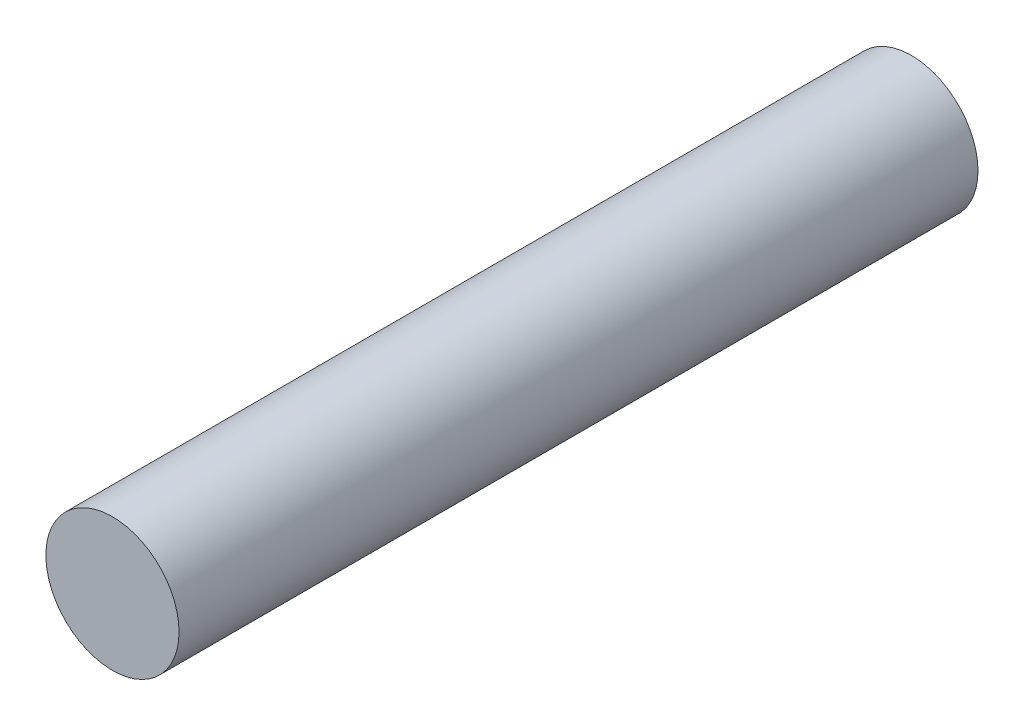
ISO-10303-21;
HEADER;
FILE_DESCRIPTION(('STEP AP214'),'2;1');
FILE_NAME('part.step','',(''),(''),'','','');
FILE_SCHEMA(('AUTOMOTIVE_DESIGN { 1 0 10303 214 1 1 1 1 }'));
ENDSEC;
DATA;
#1=APPLICATION_CONTEXT('core data for automotive mechanical design processes');
#2=APPLICATION_PROTOCOL_DEFINITION('international standard','automotive_design',2000,#1);
#3=PRODUCT_CONTEXT('',#1,'mechanical');
#4=PRODUCT('Part','Part','',(#3));
#5=PRODUCT_RELATED_PRODUCT_CATEGORY('part','',(#4));
#6=PRODUCT_DEFINITION_FORMATION('','',#4);
#7=PRODUCT_DEFINITION_CONTEXT('part definition',#1,'design');
#8=PRODUCT_DEFINITION('design','',#6,#7);
#9=PRODUCT_DEFINITION_SHAPE('','',#8);
#10=(LENGTH_UNIT() NAMED_UNIT(*) SI_UNIT(.MILLI.,.METRE.));
#11=(NAMED_UNIT(*) PLANE_ANGLE_UNIT() SI_UNIT($,.RADIAN.));
#12=(NAMED_UNIT(*) SI_UNIT($,.STERADIAN.) SOLID_ANGLE_UNIT());
#13=UNCERTAINTY_MEASURE_WITH_UNIT(LENGTH_MEASURE(1.E-05),#10,'distance_accuracy_value','');
#14=(GEOMETRIC_REPRESENTATION_CONTEXT(3) GLOBAL_UNCERTAINTY_ASSIGNED_CONTEXT((#13)) GLOBAL_UNIT_ASSIGNED_CONTEXT((#10,
#11,#12)) REPRESENTATION_CONTEXT('',''));
#15=CARTESIAN_POINT('',(0.,0.,0.));
#16=DIRECTION('',(0.,0.,1.));
#17=DIRECTION('',(1.,0.,0.));
#18=AXIS2_PLACEMENT_3D('',#15,#16,#17);
#19=CARTESIAN_POINT('',(0.,0.,76.2));
#20=DIRECTION('',(0.,0.,-1.));
#21=DIRECTION('',(-1.,0.,0.));
#22=AXIS2_PLACEMENT_3D('',#19,#20,#21);
#23=CYLINDRICAL_SURFACE('',#22,6.35);
#24=CARTESIAN_POINT('',(0.,0.,76.2));
#25=DIRECTION('',(0.,0.,1.));
#26=DIRECTION('',(1.,0.,0.));
#27=AXIS2_PLACEMENT_3D('',#24,#25,#26);
#28=CIRCLE('',#27,6.35);
#29=CARTESIAN_POINT('',(6.35,0.,76.2));
#30=VERTEX_POINT('',#29);
#31=EDGE_CURVE('E10',#30,#30,#28,.T.);
#32=ORIENTED_EDGE('',*,*,#31,.F.);
#33=EDGE_LOOP('',(#32));
#34=FACE_BOUND('',#33,.T.);
#35=CARTESIAN_POINT('',(0.,0.,0.));
#36=DIRECTION('',(0.,0.,1.));
#37=DIRECTION('',(1.,0.,0.));
#38=AXIS2_PLACEMENT_3D('',#35,#36,#37);
#39=CIRCLE('',#38,6.35);
#40=CARTESIAN_POINT('',(6.35,0.,0.));
#41=VERTEX_POINT('',#40);
#42=EDGE_CURVE('E40',#41,#41,#39,.T.);
#43=ORIENTED_EDGE('',*,*,#42,.T.);
#44=EDGE_LOOP('',(#43));
#45=FACE_BOUND('',#44,.T.);
#46=ADVANCED_FACE('F37',(#34,#45),#23,.T.);
#47=CARTESIAN_POINT('',(0.,0.,76.2));
#48=DIRECTION('',(0.,0.,1.));
#49=DIRECTION('',(1.,0.,0.));
#50=AXIS2_PLACEMENT_3D('',#47,#48,#49);
#51=PLANE('',#50);
#52=ORIENTED_EDGE('',*,*,#31,.T.);
#53=EDGE_LOOP('',(#52));
#54=FACE_BOUND('',#53,.T.);
#55=ADVANCED_FACE('F54',(#54),#51,.T.);
#56=CARTESIAN_POINT('',(0.,0.,0.));
#57=DIRECTION('',(0.,0.,1.));
#58=DIRECTION('',(1.,0.,0.));
#59=AXIS2_PLACEMENT_3D('',#56,#57,#58);
#60=PLANE('',#59);
#61=ORIENTED_EDGE('',*,*,#42,.F.);
#62=EDGE_LOOP('',(#61));
#63=FACE_BOUND('',#62,.T.);
#64=ADVANCED_FACE('F52',(#63),#60,.F.);
#65=CLOSED_SHELL('',(#46,#55,#64));
#66=MANIFOLD_SOLID_BREP('B2',#65);
#67=ADVANCED_BREP_SHAPE_REPRESENTATION('',(#18,#66),#14);
#68=SHAPE_DEFINITION_REPRESENTATION(#9,#67);
ENDSEC;
END-ISO-10303-21;
